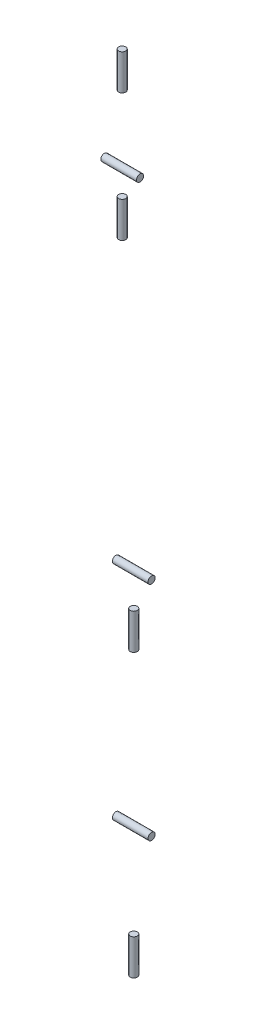
ISO-10303-21;
HEADER;
FILE_DESCRIPTION(('STEP AP214'),'2;1');
FILE_NAME('part.step','',(''),(''),'','','');
FILE_SCHEMA(('AUTOMOTIVE_DESIGN { 1 0 10303 214 1 1 1 1 }'));
ENDSEC;
DATA;
#1=APPLICATION_CONTEXT('core data for automotive mechanical design processes');
#2=APPLICATION_PROTOCOL_DEFINITION('international standard','automotive_design',2000,#1);
#3=PRODUCT_CONTEXT('',#1,'mechanical');
#4=PRODUCT('Part','Part','',(#3));
#5=PRODUCT_RELATED_PRODUCT_CATEGORY('part','',(#4));
#6=PRODUCT_DEFINITION_FORMATION('','',#4);
#7=PRODUCT_DEFINITION_CONTEXT('part definition',#1,'design');
#8=PRODUCT_DEFINITION('design','',#6,#7);
#9=PRODUCT_DEFINITION_SHAPE('','',#8);
#10=(LENGTH_UNIT() NAMED_UNIT(*) SI_UNIT(.MILLI.,.METRE.));
#11=(NAMED_UNIT(*) PLANE_ANGLE_UNIT() SI_UNIT($,.RADIAN.));
#12=(NAMED_UNIT(*) SI_UNIT($,.STERADIAN.) SOLID_ANGLE_UNIT());
#13=UNCERTAINTY_MEASURE_WITH_UNIT(LENGTH_MEASURE(1.E-05),#10,'distance_accuracy_value','');
#14=(GEOMETRIC_REPRESENTATION_CONTEXT(3) GLOBAL_UNCERTAINTY_ASSIGNED_CONTEXT((#13)) GLOBAL_UNIT_ASSIGNED_CONTEXT((#10,
#11,#12)) REPRESENTATION_CONTEXT('',''));
#15=CARTESIAN_POINT('',(0.,0.,0.));
#16=DIRECTION('',(0.,0.,1.));
#17=DIRECTION('',(1.,0.,0.));
#18=AXIS2_PLACEMENT_3D('',#15,#16,#17);
#19=CARTESIAN_POINT('',(0.,566.525,8.1));
#20=DIRECTION('',(0.,-1.,0.));
#21=DIRECTION('',(0.,0.,-1.));
#22=AXIS2_PLACEMENT_3D('',#19,#20,#21);
#23=CYLINDRICAL_SURFACE('',#22,2.5);
#24=CARTESIAN_POINT('',(0.,566.525,8.1));
#25=DIRECTION('',(0.,1.,0.));
#26=DIRECTION('',(0.,0.,1.));
#27=AXIS2_PLACEMENT_3D('',#24,#25,#26);
#28=CIRCLE('',#27,2.5);
#29=CARTESIAN_POINT('',(0.,566.525,10.6));
#30=VERTEX_POINT('',#29);
#31=EDGE_CURVE('E11',#30,#30,#28,.T.);
#32=ORIENTED_EDGE('',*,*,#31,.F.);
#33=EDGE_LOOP('',(#32));
#34=FACE_BOUND('',#33,.T.);
#35=CARTESIAN_POINT('',(0.,541.525,8.1));
#36=DIRECTION('',(0.,1.,0.));
#37=DIRECTION('',(0.,0.,1.));
#38=AXIS2_PLACEMENT_3D('',#35,#36,#37);
#39=CIRCLE('',#38,2.5);
#40=CARTESIAN_POINT('',(0.,541.525,10.6));
#41=VERTEX_POINT('',#40);
#42=EDGE_CURVE('E41',#41,#41,#39,.T.);
#43=ORIENTED_EDGE('',*,*,#42,.T.);
#44=EDGE_LOOP('',(#43));
#45=FACE_BOUND('',#44,.T.);
#46=ADVANCED_FACE('F38',(#34,#45),#23,.T.);
#47=CARTESIAN_POINT('',(0.,566.525,8.1));
#48=DIRECTION('',(0.,1.,0.));
#49=DIRECTION('',(0.,0.,1.));
#50=AXIS2_PLACEMENT_3D('',#47,#48,#49);
#51=PLANE('',#50);
#52=ORIENTED_EDGE('',*,*,#31,.T.);
#53=EDGE_LOOP('',(#52));
#54=FACE_BOUND('',#53,.T.);
#55=ADVANCED_FACE('F53',(#54),#51,.T.);
#56=CARTESIAN_POINT('',(0.,541.525,8.1));
#57=DIRECTION('',(0.,1.,0.));
#58=DIRECTION('',(0.,0.,1.));
#59=AXIS2_PLACEMENT_3D('',#56,#57,#58);
#60=PLANE('',#59);
#61=ORIENTED_EDGE('',*,*,#42,.F.);
#62=EDGE_LOOP('',(#61));
#63=FACE_BOUND('',#62,.T.);
#64=ADVANCED_FACE('F51',(#63),#60,.F.);
#65=CLOSED_SHELL('',(#46,#55,#64));
#66=MANIFOLD_SOLID_BREP('B2',#65);
#67=CARTESIAN_POINT('',(12.5,494.425,8.1));
#68=DIRECTION('',(-1.,0.,0.));
#69=DIRECTION('',(0.,0.,1.));
#70=AXIS2_PLACEMENT_3D('',#67,#68,#69);
#71=CYLINDRICAL_SURFACE('',#70,2.5);
#72=CARTESIAN_POINT('',(12.5,494.425,8.1));
#73=DIRECTION('',(1.,0.,0.));
#74=DIRECTION('',(0.,0.,-1.));
#75=AXIS2_PLACEMENT_3D('',#72,#73,#74);
#76=CIRCLE('',#75,2.5);
#77=CARTESIAN_POINT('',(12.5,494.425,5.6));
#78=VERTEX_POINT('',#77);
#79=EDGE_CURVE('E37',#78,#78,#76,.T.);
#80=ORIENTED_EDGE('',*,*,#79,.F.);
#81=EDGE_LOOP('',(#80));
#82=FACE_BOUND('',#81,.T.);
#83=CARTESIAN_POINT('',(-12.5,494.425,8.1));
#84=DIRECTION('',(1.,0.,0.));
#85=DIRECTION('',(0.,0.,-1.));
#86=AXIS2_PLACEMENT_3D('',#83,#84,#85);
#87=CIRCLE('',#86,2.5);
#88=CARTESIAN_POINT('',(-12.5,494.425,5.6));
#89=VERTEX_POINT('',#88);
#90=EDGE_CURVE('E89',#89,#89,#87,.T.);
#91=ORIENTED_EDGE('',*,*,#90,.T.);
#92=EDGE_LOOP('',(#91));
#93=FACE_BOUND('',#92,.T.);
#94=ADVANCED_FACE('F86',(#82,#93),#71,.T.);
#95=CARTESIAN_POINT('',(12.5,494.425,8.1));
#96=DIRECTION('',(1.,0.,0.));
#97=DIRECTION('',(0.,0.,-1.));
#98=AXIS2_PLACEMENT_3D('',#95,#96,#97);
#99=PLANE('',#98);
#100=ORIENTED_EDGE('',*,*,#79,.T.);
#101=EDGE_LOOP('',(#100));
#102=FACE_BOUND('',#101,.T.);
#103=ADVANCED_FACE('F101',(#102),#99,.T.);
#104=CARTESIAN_POINT('',(-12.5,494.425,8.1));
#105=DIRECTION('',(1.,0.,0.));
#106=DIRECTION('',(0.,0.,-1.));
#107=AXIS2_PLACEMENT_3D('',#104,#105,#106);
#108=PLANE('',#107);
#109=ORIENTED_EDGE('',*,*,#90,.F.);
#110=EDGE_LOOP('',(#109));
#111=FACE_BOUND('',#110,.T.);
#112=ADVANCED_FACE('F99',(#111),#108,.F.);
#113=CLOSED_SHELL('',(#94,#103,#112));
#114=MANIFOLD_SOLID_BREP('B6',#113);
#115=CARTESIAN_POINT('',(0.,476.925,8.1));
#116=DIRECTION('',(0.,-1.,0.));
#117=DIRECTION('',(0.,0.,-1.));
#118=AXIS2_PLACEMENT_3D('',#115,#116,#117);
#119=CYLINDRICAL_SURFACE('',#118,2.5);
#120=CARTESIAN_POINT('',(0.,476.925,8.1));
#121=DIRECTION('',(0.,1.,0.));
#122=DIRECTION('',(0.,0.,1.));
#123=AXIS2_PLACEMENT_3D('',#120,#121,#122);
#124=CIRCLE('',#123,2.5);
#125=CARTESIAN_POINT('',(0.,476.925,10.6));
#126=VERTEX_POINT('',#125);
#127=EDGE_CURVE('E85',#126,#126,#124,.T.);
#128=ORIENTED_EDGE('',*,*,#127,.F.);
#129=EDGE_LOOP('',(#128));
#130=FACE_BOUND('',#129,.T.);
#131=CARTESIAN_POINT('',(0.,451.925,8.1));
#132=DIRECTION('',(0.,1.,0.));
#133=DIRECTION('',(0.,0.,1.));
#134=AXIS2_PLACEMENT_3D('',#131,#132,#133);
#135=CIRCLE('',#134,2.5);
#136=CARTESIAN_POINT('',(0.,451.925,10.6));
#137=VERTEX_POINT('',#136);
#138=EDGE_CURVE('E137',#137,#137,#135,.T.);
#139=ORIENTED_EDGE('',*,*,#138,.T.);
#140=EDGE_LOOP('',(#139));
#141=FACE_BOUND('',#140,.T.);
#142=ADVANCED_FACE('F134',(#130,#141),#119,.T.);
#143=CARTESIAN_POINT('',(0.,476.925,8.1));
#144=DIRECTION('',(0.,1.,0.));
#145=DIRECTION('',(0.,0.,1.));
#146=AXIS2_PLACEMENT_3D('',#143,#144,#145);
#147=PLANE('',#146);
#148=ORIENTED_EDGE('',*,*,#127,.T.);
#149=EDGE_LOOP('',(#148));
#150=FACE_BOUND('',#149,.T.);
#151=ADVANCED_FACE('F149',(#150),#147,.T.);
#152=CARTESIAN_POINT('',(0.,451.925,8.1));
#153=DIRECTION('',(0.,1.,0.));
#154=DIRECTION('',(0.,0.,1.));
#155=AXIS2_PLACEMENT_3D('',#152,#153,#154);
#156=PLANE('',#155);
#157=ORIENTED_EDGE('',*,*,#138,.F.);
#158=EDGE_LOOP('',(#157));
#159=FACE_BOUND('',#158,.T.);
#160=ADVANCED_FACE('F147',(#159),#156,.F.);
#161=CLOSED_SHELL('',(#142,#151,#160));
#162=MANIFOLD_SOLID_BREP('B32',#161);
#163=CARTESIAN_POINT('',(12.5,246.225,0.));
#164=DIRECTION('',(-1.,0.,0.));
#165=DIRECTION('',(0.,0.,1.));
#166=AXIS2_PLACEMENT_3D('',#163,#164,#165);
#167=CYLINDRICAL_SURFACE('',#166,2.5);
#168=CARTESIAN_POINT('',(12.5,246.225,0.));
#169=DIRECTION('',(1.,0.,0.));
#170=DIRECTION('',(0.,0.,-1.));
#171=AXIS2_PLACEMENT_3D('',#168,#169,#170);
#172=CIRCLE('',#171,2.5);
#173=CARTESIAN_POINT('',(12.5,246.225,-2.5));
#174=VERTEX_POINT('',#173);
#175=EDGE_CURVE('E133',#174,#174,#172,.T.);
#176=ORIENTED_EDGE('',*,*,#175,.F.);
#177=EDGE_LOOP('',(#176));
#178=FACE_BOUND('',#177,.T.);
#179=CARTESIAN_POINT('',(-12.5,246.225,0.));
#180=DIRECTION('',(1.,0.,0.));
#181=DIRECTION('',(0.,0.,-1.));
#182=AXIS2_PLACEMENT_3D('',#179,#180,#181);
#183=CIRCLE('',#182,2.5);
#184=CARTESIAN_POINT('',(-12.5,246.225,-2.5));
#185=VERTEX_POINT('',#184);
#186=EDGE_CURVE('E185',#185,#185,#183,.T.);
#187=ORIENTED_EDGE('',*,*,#186,.T.);
#188=EDGE_LOOP('',(#187));
#189=FACE_BOUND('',#188,.T.);
#190=ADVANCED_FACE('F182',(#178,#189),#167,.T.);
#191=CARTESIAN_POINT('',(12.5,246.225,0.));
#192=DIRECTION('',(1.,0.,0.));
#193=DIRECTION('',(0.,0.,-1.));
#194=AXIS2_PLACEMENT_3D('',#191,#192,#193);
#195=PLANE('',#194);
#196=ORIENTED_EDGE('',*,*,#175,.T.);
#197=EDGE_LOOP('',(#196));
#198=FACE_BOUND('',#197,.T.);
#199=ADVANCED_FACE('F197',(#198),#195,.T.);
#200=CARTESIAN_POINT('',(-12.5,246.225,0.));
#201=DIRECTION('',(1.,0.,0.));
#202=DIRECTION('',(0.,0.,-1.));
#203=AXIS2_PLACEMENT_3D('',#200,#201,#202);
#204=PLANE('',#203);
#205=ORIENTED_EDGE('',*,*,#186,.F.);
#206=EDGE_LOOP('',(#205));
#207=FACE_BOUND('',#206,.T.);
#208=ADVANCED_FACE('F195',(#207),#204,.F.);
#209=CLOSED_SHELL('',(#190,#199,#208));
#210=MANIFOLD_SOLID_BREP('B80',#209);
#211=CARTESIAN_POINT('',(0.,222.725,0.));
#212=DIRECTION('',(0.,-1.,0.));
#213=DIRECTION('',(0.,0.,-1.));
#214=AXIS2_PLACEMENT_3D('',#211,#212,#213);
#215=CYLINDRICAL_SURFACE('',#214,2.5);
#216=CARTESIAN_POINT('',(0.,222.725,0.));
#217=DIRECTION('',(0.,1.,0.));
#218=DIRECTION('',(0.,0.,1.));
#219=AXIS2_PLACEMENT_3D('',#216,#217,#218);
#220=CIRCLE('',#219,2.5);
#221=CARTESIAN_POINT('',(0.,222.725,2.5));
#222=VERTEX_POINT('',#221);
#223=EDGE_CURVE('E181',#222,#222,#220,.T.);
#224=ORIENTED_EDGE('',*,*,#223,.F.);
#225=EDGE_LOOP('',(#224));
#226=FACE_BOUND('',#225,.T.);
#227=CARTESIAN_POINT('',(0.,197.725,0.));
#228=DIRECTION('',(0.,1.,0.));
#229=DIRECTION('',(0.,0.,1.));
#230=AXIS2_PLACEMENT_3D('',#227,#228,#229);
#231=CIRCLE('',#230,2.5);
#232=CARTESIAN_POINT('',(0.,197.725,2.5));
#233=VERTEX_POINT('',#232);
#234=EDGE_CURVE('E233',#233,#233,#231,.T.);
#235=ORIENTED_EDGE('',*,*,#234,.T.);
#236=EDGE_LOOP('',(#235));
#237=FACE_BOUND('',#236,.T.);
#238=ADVANCED_FACE('F230',(#226,#237),#215,.T.);
#239=CARTESIAN_POINT('',(0.,222.725,0.));
#240=DIRECTION('',(0.,1.,0.));
#241=DIRECTION('',(0.,0.,1.));
#242=AXIS2_PLACEMENT_3D('',#239,#240,#241);
#243=PLANE('',#242);
#244=ORIENTED_EDGE('',*,*,#223,.T.);
#245=EDGE_LOOP('',(#244));
#246=FACE_BOUND('',#245,.T.);
#247=ADVANCED_FACE('F245',(#246),#243,.T.);
#248=CARTESIAN_POINT('',(0.,197.725,0.));
#249=DIRECTION('',(0.,1.,0.));
#250=DIRECTION('',(0.,0.,1.));
#251=AXIS2_PLACEMENT_3D('',#248,#249,#250);
#252=PLANE('',#251);
#253=ORIENTED_EDGE('',*,*,#234,.F.);
#254=EDGE_LOOP('',(#253));
#255=FACE_BOUND('',#254,.T.);
#256=ADVANCED_FACE('F243',(#255),#252,.F.);
#257=CLOSED_SHELL('',(#238,#247,#256));
#258=MANIFOLD_SOLID_BREP('B128',#257);
#259=CARTESIAN_POINT('',(12.5,90.525,0.));
#260=DIRECTION('',(-1.,0.,0.));
#261=DIRECTION('',(0.,0.,1.));
#262=AXIS2_PLACEMENT_3D('',#259,#260,#261);
#263=CYLINDRICAL_SURFACE('',#262,2.5);
#264=CARTESIAN_POINT('',(12.5,90.525,0.));
#265=DIRECTION('',(1.,0.,0.));
#266=DIRECTION('',(0.,0.,-1.));
#267=AXIS2_PLACEMENT_3D('',#264,#265,#266);
#268=CIRCLE('',#267,2.5);
#269=CARTESIAN_POINT('',(12.5,90.525,-2.5));
#270=VERTEX_POINT('',#269);
#271=EDGE_CURVE('E229',#270,#270,#268,.T.);
#272=ORIENTED_EDGE('',*,*,#271,.F.);
#273=EDGE_LOOP('',(#272));
#274=FACE_BOUND('',#273,.T.);
#275=CARTESIAN_POINT('',(-12.5,90.525,0.));
#276=DIRECTION('',(1.,0.,0.));
#277=DIRECTION('',(0.,0.,-1.));
#278=AXIS2_PLACEMENT_3D('',#275,#276,#277);
#279=CIRCLE('',#278,2.5);
#280=CARTESIAN_POINT('',(-12.5,90.525,-2.5));
#281=VERTEX_POINT('',#280);
#282=EDGE_CURVE('E280',#281,#281,#279,.T.);
#283=ORIENTED_EDGE('',*,*,#282,.T.);
#284=EDGE_LOOP('',(#283));
#285=FACE_BOUND('',#284,.T.);
#286=ADVANCED_FACE('F277',(#274,#285),#263,.T.);
#287=CARTESIAN_POINT('',(12.5,90.525,0.));
#288=DIRECTION('',(1.,0.,0.));
#289=DIRECTION('',(0.,0.,-1.));
#290=AXIS2_PLACEMENT_3D('',#287,#288,#289);
#291=PLANE('',#290);
#292=ORIENTED_EDGE('',*,*,#271,.T.);
#293=EDGE_LOOP('',(#292));
#294=FACE_BOUND('',#293,.T.);
#295=ADVANCED_FACE('F292',(#294),#291,.T.);
#296=CARTESIAN_POINT('',(-12.5,90.525,0.));
#297=DIRECTION('',(1.,0.,0.));
#298=DIRECTION('',(0.,0.,-1.));
#299=AXIS2_PLACEMENT_3D('',#296,#297,#298);
#300=PLANE('',#299);
#301=ORIENTED_EDGE('',*,*,#282,.F.);
#302=EDGE_LOOP('',(#301));
#303=FACE_BOUND('',#302,.T.);
#304=ADVANCED_FACE('F290',(#303),#300,.F.);
#305=CLOSED_SHELL('',(#286,#295,#304));
#306=MANIFOLD_SOLID_BREP('B176',#305);
#307=CARTESIAN_POINT('',(0.,25.,0.));
#308=DIRECTION('',(0.,-1.,0.));
#309=DIRECTION('',(0.,0.,-1.));
#310=AXIS2_PLACEMENT_3D('',#307,#308,#309);
#311=CYLINDRICAL_SURFACE('',#310,2.5);
#312=CARTESIAN_POINT('',(0.,25.,0.));
#313=DIRECTION('',(0.,1.,0.));
#314=DIRECTION('',(0.,0.,1.));
#315=AXIS2_PLACEMENT_3D('',#312,#313,#314);
#316=CIRCLE('',#315,2.5);
#317=CARTESIAN_POINT('',(0.,25.,2.5));
#318=VERTEX_POINT('',#317);
#319=EDGE_CURVE('E276',#318,#318,#316,.T.);
#320=ORIENTED_EDGE('',*,*,#319,.F.);
#321=EDGE_LOOP('',(#320));
#322=FACE_BOUND('',#321,.T.);
#323=CARTESIAN_POINT('',(0.,0.,0.));
#324=DIRECTION('',(0.,1.,0.));
#325=DIRECTION('',(0.,0.,1.));
#326=AXIS2_PLACEMENT_3D('',#323,#324,#325);
#327=CIRCLE('',#326,2.5);
#328=CARTESIAN_POINT('',(0.,0.,2.5));
#329=VERTEX_POINT('',#328);
#330=EDGE_CURVE('E320',#329,#329,#327,.T.);
#331=ORIENTED_EDGE('',*,*,#330,.T.);
#332=EDGE_LOOP('',(#331));
#333=FACE_BOUND('',#332,.T.);
#334=ADVANCED_FACE('F317',(#322,#333),#311,.T.);
#335=CARTESIAN_POINT('',(0.,25.,0.));
#336=DIRECTION('',(0.,1.,0.));
#337=DIRECTION('',(0.,0.,1.));
#338=AXIS2_PLACEMENT_3D('',#335,#336,#337);
#339=PLANE('',#338);
#340=ORIENTED_EDGE('',*,*,#319,.T.);
#341=EDGE_LOOP('',(#340));
#342=FACE_BOUND('',#341,.T.);
#343=ADVANCED_FACE('F332',(#342),#339,.T.);
#344=CARTESIAN_POINT('',(0.,0.,0.));
#345=DIRECTION('',(0.,1.,0.));
#346=DIRECTION('',(0.,0.,1.));
#347=AXIS2_PLACEMENT_3D('',#344,#345,#346);
#348=PLANE('',#347);
#349=ORIENTED_EDGE('',*,*,#330,.F.);
#350=EDGE_LOOP('',(#349));
#351=FACE_BOUND('',#350,.T.);
#352=ADVANCED_FACE('F330',(#351),#348,.F.);
#353=CLOSED_SHELL('',(#334,#343,#352));
#354=MANIFOLD_SOLID_BREP('B224',#353);
#355=ADVANCED_BREP_SHAPE_REPRESENTATION('',(#18,#66,#114,#162,#210,#258,#306,#354),#14);
#356=SHAPE_DEFINITION_REPRESENTATION(#9,#355);
ENDSEC;
END-ISO-10303-21;
